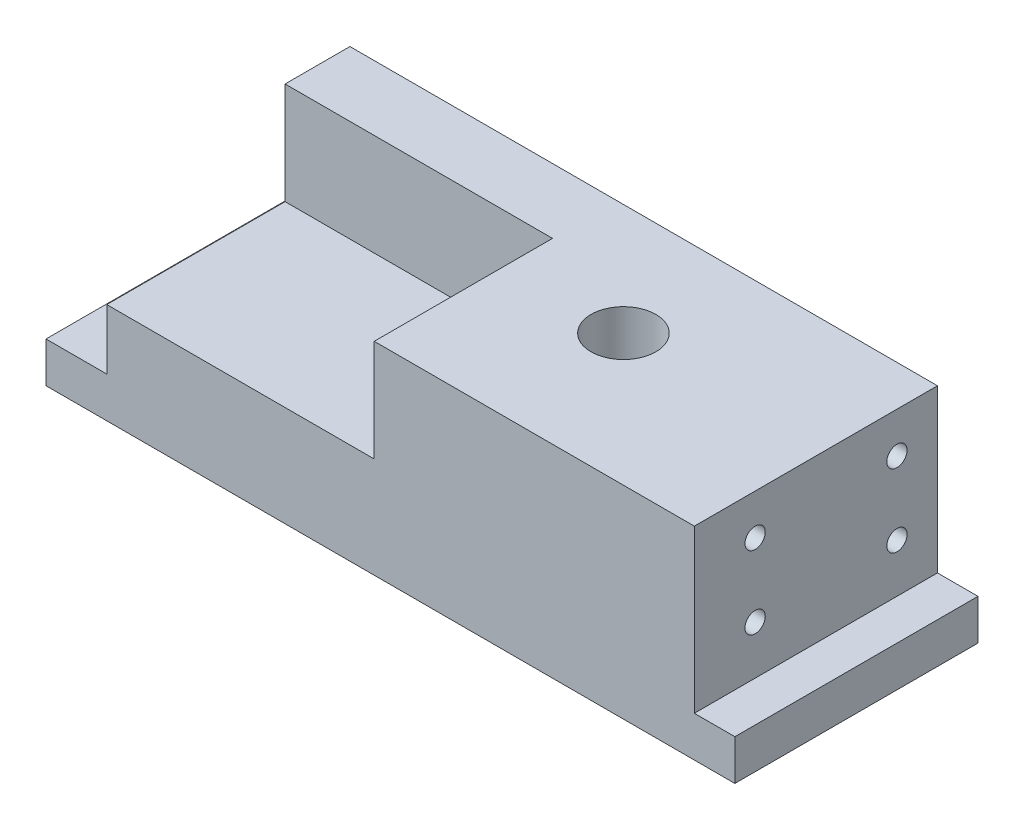
ISO-10303-21;
HEADER;
FILE_DESCRIPTION(('STEP AP214'),'2;1');
FILE_NAME('part.step','',(''),(''),'','','');
FILE_SCHEMA(('AUTOMOTIVE_DESIGN { 1 0 10303 214 1 1 1 1 }'));
ENDSEC;
DATA;
#1=APPLICATION_CONTEXT('core data for automotive mechanical design processes');
#2=APPLICATION_PROTOCOL_DEFINITION('international standard','automotive_design',2000,#1);
#3=PRODUCT_CONTEXT('',#1,'mechanical');
#4=PRODUCT('Part','Part','',(#3));
#5=PRODUCT_RELATED_PRODUCT_CATEGORY('part','',(#4));
#6=PRODUCT_DEFINITION_FORMATION('','',#4);
#7=PRODUCT_DEFINITION_CONTEXT('part definition',#1,'design');
#8=PRODUCT_DEFINITION('design','',#6,#7);
#9=PRODUCT_DEFINITION_SHAPE('','',#8);
#10=(LENGTH_UNIT() NAMED_UNIT(*) SI_UNIT(.MILLI.,.METRE.));
#11=(NAMED_UNIT(*) PLANE_ANGLE_UNIT() SI_UNIT($,.RADIAN.));
#12=(NAMED_UNIT(*) SI_UNIT($,.STERADIAN.) SOLID_ANGLE_UNIT());
#13=UNCERTAINTY_MEASURE_WITH_UNIT(LENGTH_MEASURE(1.E-05),#10,'distance_accuracy_value','');
#14=(GEOMETRIC_REPRESENTATION_CONTEXT(3) GLOBAL_UNCERTAINTY_ASSIGNED_CONTEXT((#13)) GLOBAL_UNIT_ASSIGNED_CONTEXT((#10,
#11,#12)) REPRESENTATION_CONTEXT('',''));
#15=CARTESIAN_POINT('',(0.,0.,0.));
#16=DIRECTION('',(0.,0.,1.));
#17=DIRECTION('',(1.,0.,0.));
#18=AXIS2_PLACEMENT_3D('',#15,#16,#17);
#19=CARTESIAN_POINT('',(0.,0.,65.));
#20=DIRECTION('',(0.,1.,0.));
#21=DIRECTION('',(0.,0.,1.));
#22=AXIS2_PLACEMENT_3D('',#19,#20,#21);
#23=PLANE('',#22);
#24=CARTESIAN_POINT('',(108.,0.,32.5));
#25=DIRECTION('',(0.,-1.,0.));
#26=DIRECTION('',(0.,0.,-1.));
#27=AXIS2_PLACEMENT_3D('',#24,#25,#26);
#28=CIRCLE('',#27,8.00000000000001);
#29=CARTESIAN_POINT('',(108.,0.,24.5));
#30=VERTEX_POINT('',#29);
#31=EDGE_CURVE('E223',#30,#30,#28,.T.);
#32=ORIENTED_EDGE('',*,*,#31,.F.);
#33=EDGE_LOOP('',(#32));
#34=FACE_BOUND('',#33,.T.);
#35=DIRECTION('',(-1.,0.,0.));
#36=VECTOR('',#35,1.);
#37=CARTESIAN_POINT('',(168.,0.,5.));
#38=LINE('',#37,#36);
#39=CARTESIAN_POINT('',(168.,0.,5.));
#40=VERTEX_POINT('',#39);
#41=CARTESIAN_POINT('',(-2.,0.,5.));
#42=VERTEX_POINT('',#41);
#43=EDGE_CURVE('E120',#40,#42,#38,.T.);
#44=ORIENTED_EDGE('',*,*,#43,.F.);
#45=DIRECTION('',(0.,0.,-1.));
#46=VECTOR('',#45,1.);
#47=CARTESIAN_POINT('',(168.,0.,65.));
#48=LINE('',#47,#46);
#49=CARTESIAN_POINT('',(168.,0.,65.));
#50=VERTEX_POINT('',#49);
#51=EDGE_CURVE('E11',#50,#40,#48,.T.);
#52=ORIENTED_EDGE('',*,*,#51,.F.);
#53=DIRECTION('',(1.,0.,0.));
#54=VECTOR('',#53,1.);
#55=CARTESIAN_POINT('',(0.,0.,65.));
#56=LINE('',#55,#54);
#57=CARTESIAN_POINT('',(-2.,0.,65.));
#58=VERTEX_POINT('',#57);
#59=EDGE_CURVE('E134',#58,#50,#56,.T.);
#60=ORIENTED_EDGE('',*,*,#59,.F.);
#61=DIRECTION('',(0.,0.,1.));
#62=VECTOR('',#61,1.);
#63=CARTESIAN_POINT('',(-2.,0.,5.));
#64=LINE('',#63,#62);
#65=EDGE_CURVE('E133',#42,#58,#64,.T.);
#66=ORIENTED_EDGE('',*,*,#65,.F.);
#67=EDGE_LOOP('',(#44,#52,#60,#66));
#68=FACE_BOUND('',#67,.T.);
#69=ADVANCED_FACE('F35',(#34,#68),#23,.F.);
#70=CARTESIAN_POINT('',(168.,0.,65.));
#71=DIRECTION('',(-1.,0.,0.));
#72=DIRECTION('',(0.,0.,1.));
#73=AXIS2_PLACEMENT_3D('',#70,#71,#72);
#74=PLANE('',#73);
#75=DIRECTION('',(0.,-1.,0.));
#76=VECTOR('',#75,1.);
#77=CARTESIAN_POINT('',(168.,10.,5.));
#78=LINE('',#77,#76);
#79=CARTESIAN_POINT('',(168.,10.,5.));
#80=VERTEX_POINT('',#79);
#81=EDGE_CURVE('E126',#80,#40,#78,.T.);
#82=ORIENTED_EDGE('',*,*,#81,.F.);
#83=DIRECTION('',(0.,0.,-1.));
#84=VECTOR('',#83,1.);
#85=CARTESIAN_POINT('',(168.,10.,65.));
#86=LINE('',#85,#84);
#87=CARTESIAN_POINT('',(168.,10.,65.));
#88=VERTEX_POINT('',#87);
#89=EDGE_CURVE('E43',#88,#80,#86,.T.);
#90=ORIENTED_EDGE('',*,*,#89,.F.);
#91=DIRECTION('',(0.,1.,0.));
#92=VECTOR('',#91,1.);
#93=CARTESIAN_POINT('',(168.,0.,65.));
#94=LINE('',#93,#92);
#95=EDGE_CURVE('E227',#50,#88,#94,.T.);
#96=ORIENTED_EDGE('',*,*,#95,.F.);
#97=ORIENTED_EDGE('',*,*,#51,.T.);
#98=EDGE_LOOP('',(#82,#90,#96,#97));
#99=FACE_BOUND('',#98,.T.);
#100=ADVANCED_FACE('F257',(#99),#74,.F.);
#101=CARTESIAN_POINT('',(168.,10.,65.));
#102=DIRECTION('',(0.,-1.,0.));
#103=DIRECTION('',(0.,0.,-1.));
#104=AXIS2_PLACEMENT_3D('',#101,#102,#103);
#105=PLANE('',#104);
#106=DIRECTION('',(1.,0.,0.));
#107=VECTOR('',#106,1.);
#108=CARTESIAN_POINT('',(158.,10.,5.));
#109=LINE('',#108,#107);
#110=CARTESIAN_POINT('',(158.,10.,5.));
#111=VERTEX_POINT('',#110);
#112=EDGE_CURVE('E154',#111,#80,#109,.T.);
#113=ORIENTED_EDGE('',*,*,#112,.F.);
#114=DIRECTION('',(0.,0.,-1.));
#115=VECTOR('',#114,1.);
#116=CARTESIAN_POINT('',(158.,10.,65.));
#117=LINE('',#116,#115);
#118=CARTESIAN_POINT('',(158.,10.,65.));
#119=VERTEX_POINT('',#118);
#120=EDGE_CURVE('E245',#119,#111,#117,.T.);
#121=ORIENTED_EDGE('',*,*,#120,.F.);
#122=DIRECTION('',(-1.,0.,0.));
#123=VECTOR('',#122,1.);
#124=CARTESIAN_POINT('',(168.,10.,65.));
#125=LINE('',#124,#123);
#126=EDGE_CURVE('E229',#88,#119,#125,.T.);
#127=ORIENTED_EDGE('',*,*,#126,.F.);
#128=ORIENTED_EDGE('',*,*,#89,.T.);
#129=EDGE_LOOP('',(#113,#121,#127,#128));
#130=FACE_BOUND('',#129,.T.);
#131=ADVANCED_FACE('F253',(#130),#105,.F.);
#132=CARTESIAN_POINT('',(158.,10.,65.));
#133=DIRECTION('',(-1.,0.,0.));
#134=DIRECTION('',(0.,0.,1.));
#135=AXIS2_PLACEMENT_3D('',#132,#133,#134);
#136=PLANE('',#135);
#137=CARTESIAN_POINT('',(158.,40.,50.));
#138=DIRECTION('',(1.,0.,0.));
#139=DIRECTION('',(0.,0.,-1.));
#140=AXIS2_PLACEMENT_3D('',#137,#138,#139);
#141=CIRCLE('',#140,2.5);
#142=CARTESIAN_POINT('',(158.,40.,47.5));
#143=VERTEX_POINT('',#142);
#144=EDGE_CURVE('E202',#143,#143,#141,.T.);
#145=ORIENTED_EDGE('',*,*,#144,.F.);
#146=EDGE_LOOP('',(#145));
#147=FACE_BOUND('',#146,.T.);
#148=CARTESIAN_POINT('',(158.,22.,50.));
#149=DIRECTION('',(1.,0.,0.));
#150=DIRECTION('',(0.,0.,-1.));
#151=AXIS2_PLACEMENT_3D('',#148,#149,#150);
#152=CIRCLE('',#151,2.5);
#153=CARTESIAN_POINT('',(158.,22.,47.5));
#154=VERTEX_POINT('',#153);
#155=EDGE_CURVE('E196',#154,#154,#152,.T.);
#156=ORIENTED_EDGE('',*,*,#155,.F.);
#157=EDGE_LOOP('',(#156));
#158=FACE_BOUND('',#157,.T.);
#159=CARTESIAN_POINT('',(158.,22.,15.));
#160=DIRECTION('',(1.,0.,0.));
#161=DIRECTION('',(0.,0.,-1.));
#162=AXIS2_PLACEMENT_3D('',#159,#160,#161);
#163=CIRCLE('',#162,2.5);
#164=CARTESIAN_POINT('',(158.,22.,12.5));
#165=VERTEX_POINT('',#164);
#166=EDGE_CURVE('E190',#165,#165,#163,.T.);
#167=ORIENTED_EDGE('',*,*,#166,.F.);
#168=EDGE_LOOP('',(#167));
#169=FACE_BOUND('',#168,.T.);
#170=CARTESIAN_POINT('',(158.,40.,15.));
#171=DIRECTION('',(1.,0.,0.));
#172=DIRECTION('',(0.,0.,-1.));
#173=AXIS2_PLACEMENT_3D('',#170,#171,#172);
#174=CIRCLE('',#173,2.5);
#175=CARTESIAN_POINT('',(158.,40.,12.5));
#176=VERTEX_POINT('',#175);
#177=EDGE_CURVE('E184',#176,#176,#174,.T.);
#178=ORIENTED_EDGE('',*,*,#177,.F.);
#179=EDGE_LOOP('',(#178));
#180=FACE_BOUND('',#179,.T.);
#181=DIRECTION('',(0.,-1.,0.));
#182=VECTOR('',#181,1.);
#183=CARTESIAN_POINT('',(158.,50.,5.));
#184=LINE('',#183,#182);
#185=CARTESIAN_POINT('',(158.,50.,5.));
#186=VERTEX_POINT('',#185);
#187=EDGE_CURVE('E152',#186,#111,#184,.T.);
#188=ORIENTED_EDGE('',*,*,#187,.F.);
#189=DIRECTION('',(0.,0.,-1.));
#190=VECTOR('',#189,1.);
#191=CARTESIAN_POINT('',(158.,50.,65.));
#192=LINE('',#191,#190);
#193=CARTESIAN_POINT('',(158.,50.,65.));
#194=VERTEX_POINT('',#193);
#195=EDGE_CURVE('E242',#194,#186,#192,.T.);
#196=ORIENTED_EDGE('',*,*,#195,.F.);
#197=DIRECTION('',(0.,1.,0.));
#198=VECTOR('',#197,1.);
#199=CARTESIAN_POINT('',(158.,10.,65.));
#200=LINE('',#199,#198);
#201=EDGE_CURVE('E231',#119,#194,#200,.T.);
#202=ORIENTED_EDGE('',*,*,#201,.F.);
#203=ORIENTED_EDGE('',*,*,#120,.T.);
#204=EDGE_LOOP('',(#188,#196,#202,#203));
#205=FACE_BOUND('',#204,.T.);
#206=ADVANCED_FACE('F274',(#147,#158,#169,#180,#205),#136,.F.);
#207=CARTESIAN_POINT('',(158.,50.,65.));
#208=DIRECTION('',(0.,-1.,0.));
#209=DIRECTION('',(1.,0.,0.));
#210=AXIS2_PLACEMENT_3D('',#207,#208,#209);
#211=PLANE('',#210);
#212=CARTESIAN_POINT('',(108.,50.,32.5));
#213=DIRECTION('',(0.,-1.,0.));
#214=DIRECTION('',(1.,0.,0.));
#215=AXIS2_PLACEMENT_3D('',#212,#213,#214);
#216=CIRCLE('',#215,8.00000000000001);
#217=CARTESIAN_POINT('',(116.,50.,32.5));
#218=VERTEX_POINT('',#217);
#219=EDGE_CURVE('E38',#218,#218,#216,.T.);
#220=ORIENTED_EDGE('',*,*,#219,.T.);
#221=EDGE_LOOP('',(#220));
#222=FACE_BOUND('',#221,.T.);
#223=DIRECTION('',(1.,0.,0.));
#224=VECTOR('',#223,1.);
#225=CARTESIAN_POINT('',(13.,50.,5.));
#226=LINE('',#225,#224);
#227=CARTESIAN_POINT('',(13.,50.,5.));
#228=VERTEX_POINT('',#227);
#229=EDGE_CURVE('E150',#228,#186,#226,.T.);
#230=ORIENTED_EDGE('',*,*,#229,.F.);
#231=DIRECTION('',(0.,0.,-1.));
#232=VECTOR('',#231,1.);
#233=CARTESIAN_POINT('',(13.,50.,0.));
#234=LINE('',#233,#232);
#235=CARTESIAN_POINT('',(13.,50.,21.));
#236=VERTEX_POINT('',#235);
#237=EDGE_CURVE('E166',#236,#228,#234,.T.);
#238=ORIENTED_EDGE('',*,*,#237,.F.);
#239=DIRECTION('',(-1.,0.,0.));
#240=VECTOR('',#239,1.);
#241=CARTESIAN_POINT('',(79.,50.,21.));
#242=LINE('',#241,#240);
#243=CARTESIAN_POINT('',(79.,50.,21.));
#244=VERTEX_POINT('',#243);
#245=EDGE_CURVE('E171',#244,#236,#242,.T.);
#246=ORIENTED_EDGE('',*,*,#245,.F.);
#247=DIRECTION('',(0.,0.,-1.));
#248=VECTOR('',#247,1.);
#249=CARTESIAN_POINT('',(79.,50.,120.));
#250=LINE('',#249,#248);
#251=CARTESIAN_POINT('',(79.,50.,65.));
#252=VERTEX_POINT('',#251);
#253=EDGE_CURVE('E208',#252,#244,#250,.T.);
#254=ORIENTED_EDGE('',*,*,#253,.F.);
#255=DIRECTION('',(-1.,0.,0.));
#256=VECTOR('',#255,1.);
#257=CARTESIAN_POINT('',(158.,50.,65.));
#258=LINE('',#257,#256);
#259=EDGE_CURVE('E233',#194,#252,#258,.T.);
#260=ORIENTED_EDGE('',*,*,#259,.F.);
#261=ORIENTED_EDGE('',*,*,#195,.T.);
#262=EDGE_LOOP('',(#230,#238,#246,#254,#260,#261));
#263=FACE_BOUND('',#262,.T.);
#264=ADVANCED_FACE('F268',(#222,#263),#211,.F.);
#265=CARTESIAN_POINT('',(13.,50.,65.));
#266=DIRECTION('',(1.,0.,0.));
#267=DIRECTION('',(0.,1.,0.));
#268=AXIS2_PLACEMENT_3D('',#265,#266,#267);
#269=PLANE('',#268);
#270=CARTESIAN_POINT('',(13.,18.,15.));
#271=DIRECTION('',(-1.,0.,0.));
#272=DIRECTION('',(0.,-1.,0.));
#273=AXIS2_PLACEMENT_3D('',#270,#271,#272);
#274=CIRCLE('',#273,2.5);
#275=CARTESIAN_POINT('',(13.,15.5,15.));
#276=VERTEX_POINT('',#275);
#277=EDGE_CURVE('E178',#276,#276,#274,.T.);
#278=ORIENTED_EDGE('',*,*,#277,.F.);
#279=EDGE_LOOP('',(#278));
#280=FACE_BOUND('',#279,.T.);
#281=CARTESIAN_POINT('',(13.,18.,50.));
#282=DIRECTION('',(-1.,0.,0.));
#283=DIRECTION('',(0.,-1.,0.));
#284=AXIS2_PLACEMENT_3D('',#281,#282,#283);
#285=CIRCLE('',#284,2.5);
#286=CARTESIAN_POINT('',(13.,15.5,50.));
#287=VERTEX_POINT('',#286);
#288=EDGE_CURVE('E173',#287,#287,#285,.T.);
#289=ORIENTED_EDGE('',*,*,#288,.F.);
#290=EDGE_LOOP('',(#289));
#291=FACE_BOUND('',#290,.T.);
#292=CARTESIAN_POINT('',(13.,40.,15.));
#293=DIRECTION('',(-1.,0.,0.));
#294=DIRECTION('',(0.,-1.,0.));
#295=AXIS2_PLACEMENT_3D('',#292,#293,#294);
#296=CIRCLE('',#295,2.5);
#297=CARTESIAN_POINT('',(13.,37.5,15.));
#298=VERTEX_POINT('',#297);
#299=EDGE_CURVE('E157',#298,#298,#296,.T.);
#300=ORIENTED_EDGE('',*,*,#299,.F.);
#301=EDGE_LOOP('',(#300));
#302=FACE_BOUND('',#301,.T.);
#303=DIRECTION('',(0.,1.,0.));
#304=VECTOR('',#303,1.);
#305=CARTESIAN_POINT('',(13.,10.,5.));
#306=LINE('',#305,#304);
#307=CARTESIAN_POINT('',(13.,10.,5.));
#308=VERTEX_POINT('',#307);
#309=EDGE_CURVE('E148',#308,#228,#306,.T.);
#310=ORIENTED_EDGE('',*,*,#309,.F.);
#311=DIRECTION('',(0.,0.,-1.));
#312=VECTOR('',#311,1.);
#313=CARTESIAN_POINT('',(13.,10.,65.));
#314=LINE('',#313,#312);
#315=CARTESIAN_POINT('',(13.,10.,65.));
#316=VERTEX_POINT('',#315);
#317=EDGE_CURVE('E239',#316,#308,#314,.T.);
#318=ORIENTED_EDGE('',*,*,#317,.F.);
#319=DIRECTION('',(0.,-1.,0.));
#320=VECTOR('',#319,1.);
#321=CARTESIAN_POINT('',(13.,50.,65.));
#322=LINE('',#321,#320);
#323=CARTESIAN_POINT('',(13.,24.85,65.));
#324=VERTEX_POINT('',#323);
#325=EDGE_CURVE('E58',#324,#316,#322,.T.);
#326=ORIENTED_EDGE('',*,*,#325,.F.);
#327=DIRECTION('',(0.,0.,-1.));
#328=VECTOR('',#327,1.);
#329=CARTESIAN_POINT('',(13.,24.85,120.));
#330=LINE('',#329,#328);
#331=CARTESIAN_POINT('',(13.,24.85,21.));
#332=VERTEX_POINT('',#331);
#333=EDGE_CURVE('E211',#324,#332,#330,.T.);
#334=ORIENTED_EDGE('',*,*,#333,.T.);
#335=DIRECTION('',(0.,1.,0.));
#336=VECTOR('',#335,1.);
#337=CARTESIAN_POINT('',(13.,24.85,21.));
#338=LINE('',#337,#336);
#339=EDGE_CURVE('E161',#332,#236,#338,.T.);
#340=ORIENTED_EDGE('',*,*,#339,.T.);
#341=ORIENTED_EDGE('',*,*,#237,.T.);
#342=EDGE_LOOP('',(#310,#318,#326,#334,#340,#341));
#343=FACE_BOUND('',#342,.T.);
#344=ADVANCED_FACE('F265',(#280,#291,#302,#343),#269,.F.);
#345=CARTESIAN_POINT('',(13.,10.,65.));
#346=DIRECTION('',(0.,-1.,0.));
#347=DIRECTION('',(0.,0.,-1.));
#348=AXIS2_PLACEMENT_3D('',#345,#346,#347);
#349=PLANE('',#348);
#350=DIRECTION('',(1.,0.,0.));
#351=VECTOR('',#350,1.);
#352=CARTESIAN_POINT('',(0.,10.,5.));
#353=LINE('',#352,#351);
#354=CARTESIAN_POINT('',(-2.,10.,5.));
#355=VERTEX_POINT('',#354);
#356=EDGE_CURVE('E129',#355,#308,#353,.T.);
#357=ORIENTED_EDGE('',*,*,#356,.F.);
#358=DIRECTION('',(0.,0.,-1.));
#359=VECTOR('',#358,1.);
#360=CARTESIAN_POINT('',(-2.,10.,5.));
#361=LINE('',#360,#359);
#362=CARTESIAN_POINT('',(-2.,10.,65.));
#363=VERTEX_POINT('',#362);
#364=EDGE_CURVE('E130',#363,#355,#361,.T.);
#365=ORIENTED_EDGE('',*,*,#364,.F.);
#366=DIRECTION('',(-1.,0.,0.));
#367=VECTOR('',#366,1.);
#368=CARTESIAN_POINT('',(13.,10.,65.));
#369=LINE('',#368,#367);
#370=EDGE_CURVE('E237',#316,#363,#369,.T.);
#371=ORIENTED_EDGE('',*,*,#370,.F.);
#372=ORIENTED_EDGE('',*,*,#317,.T.);
#373=EDGE_LOOP('',(#357,#365,#371,#372));
#374=FACE_BOUND('',#373,.T.);
#375=ADVANCED_FACE('F261',(#374),#349,.F.);
#376=CARTESIAN_POINT('',(0.,0.,65.));
#377=DIRECTION('',(0.,0.,1.));
#378=DIRECTION('',(1.,0.,0.));
#379=AXIS2_PLACEMENT_3D('',#376,#377,#378);
#380=PLANE('',#379);
#381=DIRECTION('',(1.,0.,0.));
#382=VECTOR('',#381,1.);
#383=CARTESIAN_POINT('',(0.,24.85,65.));
#384=LINE('',#383,#382);
#385=CARTESIAN_POINT('',(79.,24.85,65.));
#386=VERTEX_POINT('',#385);
#387=EDGE_CURVE('E221',#324,#386,#384,.T.);
#388=ORIENTED_EDGE('',*,*,#387,.F.);
#389=ORIENTED_EDGE('',*,*,#325,.T.);
#390=ORIENTED_EDGE('',*,*,#370,.T.);
#391=DIRECTION('',(0.,1.,0.));
#392=VECTOR('',#391,1.);
#393=CARTESIAN_POINT('',(-2.,10.,65.));
#394=LINE('',#393,#392);
#395=EDGE_CURVE('E138',#58,#363,#394,.T.);
#396=ORIENTED_EDGE('',*,*,#395,.F.);
#397=ORIENTED_EDGE('',*,*,#59,.T.);
#398=ORIENTED_EDGE('',*,*,#95,.T.);
#399=ORIENTED_EDGE('',*,*,#126,.T.);
#400=ORIENTED_EDGE('',*,*,#201,.T.);
#401=ORIENTED_EDGE('',*,*,#259,.T.);
#402=DIRECTION('',(0.,1.,0.));
#403=VECTOR('',#402,1.);
#404=CARTESIAN_POINT('',(79.,0.,65.));
#405=LINE('',#404,#403);
#406=EDGE_CURVE('E214',#386,#252,#405,.T.);
#407=ORIENTED_EDGE('',*,*,#406,.F.);
#408=EDGE_LOOP('',(#388,#389,#390,#396,#397,#398,#399,#400,#401,#407));
#409=FACE_BOUND('',#408,.T.);
#410=ADVANCED_FACE('F258',(#409),#380,.T.);
#411=CARTESIAN_POINT('',(108.,85.,32.5));
#412=DIRECTION('',(0.,-1.,0.));
#413=DIRECTION('',(0.,0.,-1.));
#414=AXIS2_PLACEMENT_3D('',#411,#412,#413);
#415=CYLINDRICAL_SURFACE('',#414,8.00000000000001);
#416=ORIENTED_EDGE('',*,*,#31,.T.);
#417=EDGE_LOOP('',(#416));
#418=FACE_BOUND('',#417,.T.);
#419=ORIENTED_EDGE('',*,*,#219,.F.);
#420=EDGE_LOOP('',(#419));
#421=FACE_BOUND('',#420,.T.);
#422=ADVANCED_FACE('F283',(#418,#421),#415,.F.);
#423=CARTESIAN_POINT('',(13.,24.85,120.));
#424=DIRECTION('',(0.,-1.,0.));
#425=DIRECTION('',(1.,0.,0.));
#426=AXIS2_PLACEMENT_3D('',#423,#424,#425);
#427=PLANE('',#426);
#428=DIRECTION('',(0.,0.,-1.));
#429=VECTOR('',#428,1.);
#430=CARTESIAN_POINT('',(79.,24.85,120.));
#431=LINE('',#430,#429);
#432=CARTESIAN_POINT('',(79.,24.85,21.));
#433=VERTEX_POINT('',#432);
#434=EDGE_CURVE('E215',#386,#433,#431,.T.);
#435=ORIENTED_EDGE('',*,*,#434,.T.);
#436=DIRECTION('',(-1.,0.,0.));
#437=VECTOR('',#436,1.);
#438=CARTESIAN_POINT('',(79.,24.85,21.));
#439=LINE('',#438,#437);
#440=EDGE_CURVE('E50',#433,#332,#439,.T.);
#441=ORIENTED_EDGE('',*,*,#440,.T.);
#442=ORIENTED_EDGE('',*,*,#333,.F.);
#443=ORIENTED_EDGE('',*,*,#387,.T.);
#444=EDGE_LOOP('',(#435,#441,#442,#443));
#445=FACE_BOUND('',#444,.T.);
#446=ADVANCED_FACE('F281',(#445),#427,.F.);
#447=CARTESIAN_POINT('',(79.,50.,120.));
#448=DIRECTION('',(1.,0.,0.));
#449=DIRECTION('',(0.,1.,0.));
#450=AXIS2_PLACEMENT_3D('',#447,#448,#449);
#451=PLANE('',#450);
#452=ORIENTED_EDGE('',*,*,#253,.T.);
#453=DIRECTION('',(0.,1.,0.));
#454=VECTOR('',#453,1.);
#455=CARTESIAN_POINT('',(79.,24.85,21.));
#456=LINE('',#455,#454);
#457=EDGE_CURVE('E164',#433,#244,#456,.T.);
#458=ORIENTED_EDGE('',*,*,#457,.F.);
#459=ORIENTED_EDGE('',*,*,#434,.F.);
#460=ORIENTED_EDGE('',*,*,#406,.T.);
#461=EDGE_LOOP('',(#452,#458,#459,#460));
#462=FACE_BOUND('',#461,.T.);
#463=ADVANCED_FACE('F278',(#462),#451,.F.);
#464=CARTESIAN_POINT('',(143.,40.,50.));
#465=DIRECTION('',(1.,0.,0.));
#466=DIRECTION('',(0.,0.,-1.));
#467=AXIS2_PLACEMENT_3D('',#464,#465,#466);
#468=CYLINDRICAL_SURFACE('',#467,2.5);
#469=CARTESIAN_POINT('',(143.,40.,50.));
#470=DIRECTION('',(1.,0.,0.));
#471=DIRECTION('',(0.,0.,-1.));
#472=AXIS2_PLACEMENT_3D('',#469,#470,#471);
#473=CIRCLE('',#472,2.5);
#474=CARTESIAN_POINT('',(143.,40.,47.5));
#475=VERTEX_POINT('',#474);
#476=EDGE_CURVE('E205',#475,#475,#473,.T.);
#477=ORIENTED_EDGE('',*,*,#476,.F.);
#478=EDGE_LOOP('',(#477));
#479=FACE_BOUND('',#478,.T.);
#480=ORIENTED_EDGE('',*,*,#144,.T.);
#481=EDGE_LOOP('',(#480));
#482=FACE_BOUND('',#481,.T.);
#483=ADVANCED_FACE('F289',(#479,#482),#468,.F.);
#484=CARTESIAN_POINT('',(143.,40.,50.));
#485=DIRECTION('',(1.,0.,0.));
#486=DIRECTION('',(0.,0.,-1.));
#487=AXIS2_PLACEMENT_3D('',#484,#485,#486);
#488=PLANE('',#487);
#489=ORIENTED_EDGE('',*,*,#476,.T.);
#490=EDGE_LOOP('',(#489));
#491=FACE_BOUND('',#490,.T.);
#492=ADVANCED_FACE('F437',(#491),#488,.T.);
#493=CARTESIAN_POINT('',(143.,22.,50.));
#494=DIRECTION('',(1.,0.,0.));
#495=DIRECTION('',(0.,0.,-1.));
#496=AXIS2_PLACEMENT_3D('',#493,#494,#495);
#497=CYLINDRICAL_SURFACE('',#496,2.5);
#498=CARTESIAN_POINT('',(143.,22.,50.));
#499=DIRECTION('',(1.,0.,0.));
#500=DIRECTION('',(0.,0.,-1.));
#501=AXIS2_PLACEMENT_3D('',#498,#499,#500);
#502=CIRCLE('',#501,2.5);
#503=CARTESIAN_POINT('',(143.,22.,47.5));
#504=VERTEX_POINT('',#503);
#505=EDGE_CURVE('E199',#504,#504,#502,.T.);
#506=ORIENTED_EDGE('',*,*,#505,.F.);
#507=EDGE_LOOP('',(#506));
#508=FACE_BOUND('',#507,.T.);
#509=ORIENTED_EDGE('',*,*,#155,.T.);
#510=EDGE_LOOP('',(#509));
#511=FACE_BOUND('',#510,.T.);
#512=ADVANCED_FACE('F433',(#508,#511),#497,.F.);
#513=CARTESIAN_POINT('',(143.,22.,50.));
#514=DIRECTION('',(1.,0.,0.));
#515=DIRECTION('',(0.,0.,-1.));
#516=AXIS2_PLACEMENT_3D('',#513,#514,#515);
#517=PLANE('',#516);
#518=ORIENTED_EDGE('',*,*,#505,.T.);
#519=EDGE_LOOP('',(#518));
#520=FACE_BOUND('',#519,.T.);
#521=ADVANCED_FACE('F429',(#520),#517,.T.);
#522=CARTESIAN_POINT('',(143.,22.,15.));
#523=DIRECTION('',(1.,0.,0.));
#524=DIRECTION('',(0.,0.,-1.));
#525=AXIS2_PLACEMENT_3D('',#522,#523,#524);
#526=CYLINDRICAL_SURFACE('',#525,2.5);
#527=CARTESIAN_POINT('',(143.,22.,15.));
#528=DIRECTION('',(1.,0.,0.));
#529=DIRECTION('',(0.,0.,-1.));
#530=AXIS2_PLACEMENT_3D('',#527,#528,#529);
#531=CIRCLE('',#530,2.5);
#532=CARTESIAN_POINT('',(143.,22.,12.5));
#533=VERTEX_POINT('',#532);
#534=EDGE_CURVE('E193',#533,#533,#531,.T.);
#535=ORIENTED_EDGE('',*,*,#534,.F.);
#536=EDGE_LOOP('',(#535));
#537=FACE_BOUND('',#536,.T.);
#538=ORIENTED_EDGE('',*,*,#166,.T.);
#539=EDGE_LOOP('',(#538));
#540=FACE_BOUND('',#539,.T.);
#541=ADVANCED_FACE('F425',(#537,#540),#526,.F.);
#542=CARTESIAN_POINT('',(143.,22.,15.));
#543=DIRECTION('',(1.,0.,0.));
#544=DIRECTION('',(0.,0.,-1.));
#545=AXIS2_PLACEMENT_3D('',#542,#543,#544);
#546=PLANE('',#545);
#547=ORIENTED_EDGE('',*,*,#534,.T.);
#548=EDGE_LOOP('',(#547));
#549=FACE_BOUND('',#548,.T.);
#550=ADVANCED_FACE('F421',(#549),#546,.T.);
#551=CARTESIAN_POINT('',(143.,40.,15.));
#552=DIRECTION('',(1.,0.,0.));
#553=DIRECTION('',(0.,0.,-1.));
#554=AXIS2_PLACEMENT_3D('',#551,#552,#553);
#555=CYLINDRICAL_SURFACE('',#554,2.5);
#556=CARTESIAN_POINT('',(143.,40.,15.));
#557=DIRECTION('',(1.,0.,0.));
#558=DIRECTION('',(0.,0.,-1.));
#559=AXIS2_PLACEMENT_3D('',#556,#557,#558);
#560=CIRCLE('',#559,2.5);
#561=CARTESIAN_POINT('',(143.,40.,12.5));
#562=VERTEX_POINT('',#561);
#563=EDGE_CURVE('E187',#562,#562,#560,.T.);
#564=ORIENTED_EDGE('',*,*,#563,.F.);
#565=EDGE_LOOP('',(#564));
#566=FACE_BOUND('',#565,.T.);
#567=ORIENTED_EDGE('',*,*,#177,.T.);
#568=EDGE_LOOP('',(#567));
#569=FACE_BOUND('',#568,.T.);
#570=ADVANCED_FACE('F417',(#566,#569),#555,.F.);
#571=CARTESIAN_POINT('',(143.,40.,15.));
#572=DIRECTION('',(1.,0.,0.));
#573=DIRECTION('',(0.,0.,-1.));
#574=AXIS2_PLACEMENT_3D('',#571,#572,#573);
#575=PLANE('',#574);
#576=ORIENTED_EDGE('',*,*,#563,.T.);
#577=EDGE_LOOP('',(#576));
#578=FACE_BOUND('',#577,.T.);
#579=ADVANCED_FACE('F413',(#578),#575,.T.);
#580=CARTESIAN_POINT('',(25.,18.,15.));
#581=DIRECTION('',(-1.,0.,0.));
#582=DIRECTION('',(0.,-1.,0.));
#583=AXIS2_PLACEMENT_3D('',#580,#581,#582);
#584=CYLINDRICAL_SURFACE('',#583,2.5);
#585=CARTESIAN_POINT('',(25.,18.,15.));
#586=DIRECTION('',(-1.,0.,0.));
#587=DIRECTION('',(0.,-1.,0.));
#588=AXIS2_PLACEMENT_3D('',#585,#586,#587);
#589=CIRCLE('',#588,2.5);
#590=CARTESIAN_POINT('',(25.,15.5,15.));
#591=VERTEX_POINT('',#590);
#592=EDGE_CURVE('E181',#591,#591,#589,.T.);
#593=ORIENTED_EDGE('',*,*,#592,.F.);
#594=EDGE_LOOP('',(#593));
#595=FACE_BOUND('',#594,.T.);
#596=ORIENTED_EDGE('',*,*,#277,.T.);
#597=EDGE_LOOP('',(#596));
#598=FACE_BOUND('',#597,.T.);
#599=ADVANCED_FACE('F409',(#595,#598),#584,.F.);
#600=CARTESIAN_POINT('',(25.,18.,15.));
#601=DIRECTION('',(-1.,0.,0.));
#602=DIRECTION('',(0.,-1.,0.));
#603=AXIS2_PLACEMENT_3D('',#600,#601,#602);
#604=PLANE('',#603);
#605=ORIENTED_EDGE('',*,*,#592,.T.);
#606=EDGE_LOOP('',(#605));
#607=FACE_BOUND('',#606,.T.);
#608=ADVANCED_FACE('F405',(#607),#604,.T.);
#609=CARTESIAN_POINT('',(25.,18.,50.));
#610=DIRECTION('',(-1.,0.,0.));
#611=DIRECTION('',(0.,-1.,0.));
#612=AXIS2_PLACEMENT_3D('',#609,#610,#611);
#613=CYLINDRICAL_SURFACE('',#612,2.5);
#614=CARTESIAN_POINT('',(25.,18.,50.));
#615=DIRECTION('',(-1.,0.,0.));
#616=DIRECTION('',(0.,-1.,0.));
#617=AXIS2_PLACEMENT_3D('',#614,#615,#616);
#618=CIRCLE('',#617,2.5);
#619=CARTESIAN_POINT('',(25.,15.5,50.));
#620=VERTEX_POINT('',#619);
#621=EDGE_CURVE('E175',#620,#620,#618,.T.);
#622=ORIENTED_EDGE('',*,*,#621,.F.);
#623=EDGE_LOOP('',(#622));
#624=FACE_BOUND('',#623,.T.);
#625=ORIENTED_EDGE('',*,*,#288,.T.);
#626=EDGE_LOOP('',(#625));
#627=FACE_BOUND('',#626,.T.);
#628=ADVANCED_FACE('F401',(#624,#627),#613,.F.);
#629=CARTESIAN_POINT('',(25.,18.,50.));
#630=DIRECTION('',(-1.,0.,0.));
#631=DIRECTION('',(0.,-1.,0.));
#632=AXIS2_PLACEMENT_3D('',#629,#630,#631);
#633=PLANE('',#632);
#634=ORIENTED_EDGE('',*,*,#621,.T.);
#635=EDGE_LOOP('',(#634));
#636=FACE_BOUND('',#635,.T.);
#637=ADVANCED_FACE('F398',(#636),#633,.T.);
#638=CARTESIAN_POINT('',(79.,24.85,21.));
#639=DIRECTION('',(0.,0.,1.));
#640=DIRECTION('',(1.,0.,0.));
#641=AXIS2_PLACEMENT_3D('',#638,#639,#640);
#642=PLANE('',#641);
#643=ORIENTED_EDGE('',*,*,#339,.F.);
#644=ORIENTED_EDGE('',*,*,#440,.F.);
#645=ORIENTED_EDGE('',*,*,#457,.T.);
#646=ORIENTED_EDGE('',*,*,#245,.T.);
#647=EDGE_LOOP('',(#643,#644,#645,#646));
#648=FACE_BOUND('',#647,.T.);
#649=ADVANCED_FACE('F394',(#648),#642,.T.);
#650=CARTESIAN_POINT('',(25.,40.,15.));
#651=DIRECTION('',(-1.,0.,0.));
#652=DIRECTION('',(0.,-1.,0.));
#653=AXIS2_PLACEMENT_3D('',#650,#651,#652);
#654=CYLINDRICAL_SURFACE('',#653,2.5);
#655=CARTESIAN_POINT('',(25.,40.,15.));
#656=DIRECTION('',(-1.,0.,0.));
#657=DIRECTION('',(0.,-1.,0.));
#658=AXIS2_PLACEMENT_3D('',#655,#656,#657);
#659=CIRCLE('',#658,2.5);
#660=CARTESIAN_POINT('',(25.,37.5,15.));
#661=VERTEX_POINT('',#660);
#662=EDGE_CURVE('E158',#661,#661,#659,.T.);
#663=ORIENTED_EDGE('',*,*,#662,.F.);
#664=EDGE_LOOP('',(#663));
#665=FACE_BOUND('',#664,.T.);
#666=ORIENTED_EDGE('',*,*,#299,.T.);
#667=EDGE_LOOP('',(#666));
#668=FACE_BOUND('',#667,.T.);
#669=ADVANCED_FACE('F390',(#665,#668),#654,.F.);
#670=CARTESIAN_POINT('',(25.,40.,15.));
#671=DIRECTION('',(-1.,0.,0.));
#672=DIRECTION('',(0.,-1.,0.));
#673=AXIS2_PLACEMENT_3D('',#670,#671,#672);
#674=PLANE('',#673);
#675=ORIENTED_EDGE('',*,*,#662,.T.);
#676=EDGE_LOOP('',(#675));
#677=FACE_BOUND('',#676,.T.);
#678=ADVANCED_FACE('F375',(#677),#674,.T.);
#679=CARTESIAN_POINT('',(0.,0.,5.));
#680=DIRECTION('',(0.,0.,-1.));
#681=DIRECTION('',(-1.,0.,0.));
#682=AXIS2_PLACEMENT_3D('',#679,#680,#681);
#683=PLANE('',#682);
#684=ORIENTED_EDGE('',*,*,#43,.T.);
#685=DIRECTION('',(0.,-1.,0.));
#686=VECTOR('',#685,1.);
#687=CARTESIAN_POINT('',(-2.,10.,5.));
#688=LINE('',#687,#686);
#689=EDGE_CURVE('E124',#355,#42,#688,.T.);
#690=ORIENTED_EDGE('',*,*,#689,.F.);
#691=ORIENTED_EDGE('',*,*,#356,.T.);
#692=ORIENTED_EDGE('',*,*,#309,.T.);
#693=ORIENTED_EDGE('',*,*,#229,.T.);
#694=ORIENTED_EDGE('',*,*,#187,.T.);
#695=ORIENTED_EDGE('',*,*,#112,.T.);
#696=ORIENTED_EDGE('',*,*,#81,.T.);
#697=EDGE_LOOP('',(#684,#690,#691,#692,#693,#694,#695,#696));
#698=FACE_BOUND('',#697,.T.);
#699=ADVANCED_FACE('F122',(#698),#683,.T.);
#700=CARTESIAN_POINT('',(-2.,0.,0.));
#701=DIRECTION('',(-1.,0.,0.));
#702=DIRECTION('',(0.,-1.,0.));
#703=AXIS2_PLACEMENT_3D('',#700,#701,#702);
#704=PLANE('',#703);
#705=ORIENTED_EDGE('',*,*,#689,.T.);
#706=ORIENTED_EDGE('',*,*,#65,.T.);
#707=ORIENTED_EDGE('',*,*,#395,.T.);
#708=ORIENTED_EDGE('',*,*,#364,.T.);
#709=EDGE_LOOP('',(#705,#706,#707,#708));
#710=FACE_BOUND('',#709,.T.);
#711=ADVANCED_FACE('F141',(#710),#704,.T.);
#712=CLOSED_SHELL('',(#69,#100,#131,#206,#264,#344,#375,#410,#422,#446,#463,#483,#492,#512,#521,
#541,#550,#570,#579,#599,#608,#628,#637,#649,#669,#678,#699,#711));
#713=MANIFOLD_SOLID_BREP('B2',#712);
#714=ADVANCED_BREP_SHAPE_REPRESENTATION('',(#18,#713),#14);
#715=SHAPE_DEFINITION_REPRESENTATION(#9,#714);
ENDSEC;
END-ISO-10303-21;
